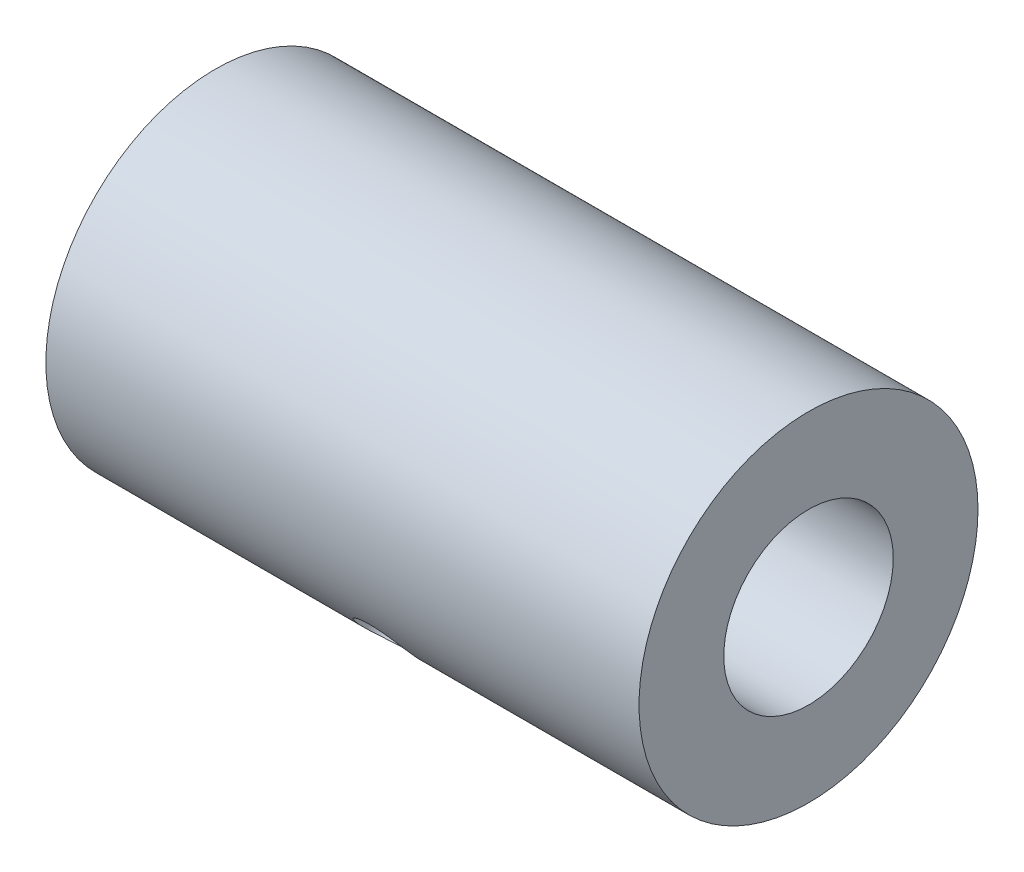
ISO-10303-21;
HEADER;
FILE_DESCRIPTION(('STEP AP214'),'2;1');
FILE_NAME('part.step','',(''),(''),'','','');
FILE_SCHEMA(('AUTOMOTIVE_DESIGN { 1 0 10303 214 1 1 1 1 }'));
ENDSEC;
DATA;
#1=APPLICATION_CONTEXT('core data for automotive mechanical design processes');
#2=APPLICATION_PROTOCOL_DEFINITION('international standard','automotive_design',2000,#1);
#3=PRODUCT_CONTEXT('',#1,'mechanical');
#4=PRODUCT('Part','Part','',(#3));
#5=PRODUCT_RELATED_PRODUCT_CATEGORY('part','',(#4));
#6=PRODUCT_DEFINITION_FORMATION('','',#4);
#7=PRODUCT_DEFINITION_CONTEXT('part definition',#1,'design');
#8=PRODUCT_DEFINITION('design','',#6,#7);
#9=PRODUCT_DEFINITION_SHAPE('','',#8);
#10=(LENGTH_UNIT() NAMED_UNIT(*) SI_UNIT(.MILLI.,.METRE.));
#11=(NAMED_UNIT(*) PLANE_ANGLE_UNIT() SI_UNIT($,.RADIAN.));
#12=(NAMED_UNIT(*) SI_UNIT($,.STERADIAN.) SOLID_ANGLE_UNIT());
#13=UNCERTAINTY_MEASURE_WITH_UNIT(LENGTH_MEASURE(1.E-05),#10,'distance_accuracy_value','');
#14=(GEOMETRIC_REPRESENTATION_CONTEXT(3) GLOBAL_UNCERTAINTY_ASSIGNED_CONTEXT((#13)) GLOBAL_UNIT_ASSIGNED_CONTEXT((#10,
#11,#12)) REPRESENTATION_CONTEXT('',''));
#15=CARTESIAN_POINT('',(0.,0.,0.));
#16=DIRECTION('',(0.,0.,1.));
#17=DIRECTION('',(1.,0.,0.));
#18=AXIS2_PLACEMENT_3D('',#15,#16,#17);
#19=CARTESIAN_POINT('',(34.9999999999995,-27.9999999999999,179.999999999996));
#20=DIRECTION('',(1.,0.,0.));
#21=DIRECTION('',(0.,0.,-1.));
#22=AXIS2_PLACEMENT_3D('',#19,#20,#21);
#23=PLANE('',#22);
#24=CARTESIAN_POINT('',(34.9999999999995,-27.9999999999999,179.999999999996));
#25=DIRECTION('',(1.,0.,0.));
#26=DIRECTION('',(0.,0.,-1.));
#27=AXIS2_PLACEMENT_3D('',#24,#25,#26);
#28=CIRCLE('',#27,20.);
#29=CARTESIAN_POINT('',(34.9999999999995,-27.9999999999999,159.999999999996));
#30=VERTEX_POINT('',#29);
#31=EDGE_CURVE('E10',#30,#30,#28,.T.);
#32=ORIENTED_EDGE('',*,*,#31,.T.);
#33=EDGE_LOOP('',(#32));
#34=FACE_BOUND('',#33,.T.);
#35=CARTESIAN_POINT('',(34.9999999999995,-27.9999999999999,179.999999999996));
#36=DIRECTION('',(1.,0.,0.));
#37=DIRECTION('',(0.,0.,-1.));
#38=AXIS2_PLACEMENT_3D('',#35,#36,#37);
#39=CIRCLE('',#38,10.);
#40=CARTESIAN_POINT('',(34.9999999999995,-27.9999999999999,169.999999999996));
#41=VERTEX_POINT('',#40);
#42=EDGE_CURVE('E46',#41,#41,#39,.T.);
#43=ORIENTED_EDGE('',*,*,#42,.F.);
#44=EDGE_LOOP('',(#43));
#45=FACE_BOUND('',#44,.T.);
#46=ADVANCED_FACE('F34',(#34,#45),#23,.T.);
#47=CARTESIAN_POINT('',(-35.0000000000005,-28.,179.999999999999));
#48=DIRECTION('',(1.,0.,0.));
#49=DIRECTION('',(0.,0.,-1.));
#50=AXIS2_PLACEMENT_3D('',#47,#48,#49);
#51=PLANE('',#50);
#52=CARTESIAN_POINT('',(-35.0000000000005,-28.,179.999999999999));
#53=DIRECTION('',(1.,0.,0.));
#54=DIRECTION('',(0.,0.,-1.));
#55=AXIS2_PLACEMENT_3D('',#52,#53,#54);
#56=CIRCLE('',#55,20.);
#57=CARTESIAN_POINT('',(-35.0000000000005,-28.,159.999999999999));
#58=VERTEX_POINT('',#57);
#59=EDGE_CURVE('E39',#58,#58,#56,.T.);
#60=ORIENTED_EDGE('',*,*,#59,.F.);
#61=EDGE_LOOP('',(#60));
#62=FACE_BOUND('',#61,.T.);
#63=CARTESIAN_POINT('',(-35.0000000000005,-28.,179.999999999999));
#64=DIRECTION('',(1.,0.,0.));
#65=DIRECTION('',(0.,0.,-1.));
#66=AXIS2_PLACEMENT_3D('',#63,#64,#65);
#67=CIRCLE('',#66,10.);
#68=CARTESIAN_POINT('',(-35.0000000000005,-28.,169.999999999999));
#69=VERTEX_POINT('',#68);
#70=EDGE_CURVE('E48',#69,#69,#67,.T.);
#71=ORIENTED_EDGE('',*,*,#70,.T.);
#72=EDGE_LOOP('',(#71));
#73=FACE_BOUND('',#72,.T.);
#74=ADVANCED_FACE('F75',(#62,#73),#51,.F.);
#75=CARTESIAN_POINT('',(34.9999999999995,-27.9999999999999,179.999999999996));
#76=DIRECTION('',(-1.,0.,0.));
#77=DIRECTION('',(0.,0.,1.));
#78=AXIS2_PLACEMENT_3D('',#75,#76,#77);
#79=CYLINDRICAL_SURFACE('',#78,20.);
#80=CARTESIAN_POINT('',(0.,-43.8478675095896,192.200208826021));
#81=CARTESIAN_POINT('',(-0.189493070074265,-43.8478642884116,192.200216500374));
#82=CARTESIAN_POINT('',(-0.379088226910519,-43.8380418027767,192.213005159529));
#83=CARTESIAN_POINT('',(-0.7529548157544,-43.7988737220687,192.26362810572));
#84=CARTESIAN_POINT('',(-0.93722123851401,-43.7695103427631,192.301485207474));
#85=CARTESIAN_POINT('',(-1.29496575548329,-43.6917161907488,192.400563797644));
#86=CARTESIAN_POINT('',(-1.46845287771228,-43.643301630247,192.461765418947));
#87=CARTESIAN_POINT('',(-1.80001657600008,-43.5281243067376,192.604989557871));
#88=CARTESIAN_POINT('',(-1.95809480216019,-43.4613635113144,192.687009842673));
#89=CARTESIAN_POINT('',(-2.25599160663239,-43.3097997578666,192.869506185747));
#90=CARTESIAN_POINT('',(-2.39562931231476,-43.2248368565512,192.970144697845));
#91=CARTESIAN_POINT('',(-2.65110950917139,-43.0386323396305,193.18558951528));
#92=CARTESIAN_POINT('',(-2.76695056764245,-42.9373897445422,193.300396672991));
#93=CARTESIAN_POINT('',(-2.97223024479482,-42.7198074031309,193.540815256522));
#94=CARTESIAN_POINT('',(-3.06150018369737,-42.6033776819167,193.666489434732));
#95=CARTESIAN_POINT('',(-3.21001898120134,-42.3584042136243,193.923639043545));
#96=CARTESIAN_POINT('',(-3.26926986995337,-42.2298612864446,194.055114081189));
#97=CARTESIAN_POINT('',(-3.35551449220155,-41.965078642617,194.318207295259));
#98=CARTESIAN_POINT('',(-3.38281229682062,-41.8289246169158,194.449811992555));
#99=CARTESIAN_POINT('',(-3.40532168994776,-41.5514842340555,194.710318513929));
#100=CARTESIAN_POINT('',(-3.40053554352118,-41.4101982399039,194.839220528166));
#101=CARTESIAN_POINT('',(-3.35924943005332,-41.1281076775969,195.089333102894));
#102=CARTESIAN_POINT('',(-3.32307672771782,-40.9873131477725,195.2106092267));
#103=CARTESIAN_POINT('',(-3.22055998370281,-40.7090528748401,195.443864724699));
#104=CARTESIAN_POINT('',(-3.15421499428137,-40.5715872364387,195.555843806732));
#105=CARTESIAN_POINT('',(-2.99291378290257,-40.3037178604791,195.76857474));
#106=CARTESIAN_POINT('',(-2.89782332628052,-40.1733507171525,195.869270810813));
#107=CARTESIAN_POINT('',(-2.68182887728862,-39.9246914722826,196.056962331432));
#108=CARTESIAN_POINT('',(-2.56092271344902,-39.8064003877464,196.143956627652));
#109=CARTESIAN_POINT('',(-2.29491554965887,-39.5845669861474,196.3038884349));
#110=CARTESIAN_POINT('',(-2.14952846863203,-39.4812296366562,196.376634695517));
#111=CARTESIAN_POINT('',(-1.83964871299826,-39.2949266598861,196.5056812871));
#112=CARTESIAN_POINT('',(-1.67515584809078,-39.2119612355445,196.561981454237));
#113=CARTESIAN_POINT('',(-1.33140168986874,-39.0695605382773,196.657497583558));
#114=CARTESIAN_POINT('',(-1.15212290614707,-39.0101536295267,196.696692957437));
#115=CARTESIAN_POINT('',(-0.784071452319234,-38.917486316467,196.757433940006));
#116=CARTESIAN_POINT('',(-0.59529965582725,-38.8842235108604,196.778981169659));
#117=CARTESIAN_POINT('',(-0.216131912408722,-38.8455207911845,196.80402364628));
#118=CARTESIAN_POINT('',(-0.0257852600498503,-38.8397404334286,196.807739784401));
#119=CARTESIAN_POINT('',(0.35332091107603,-38.8553265012548,196.797677499059));
#120=CARTESIAN_POINT('',(0.54208049342597,-38.8766918340298,196.783899779848));
#121=CARTESIAN_POINT('',(0.911376680240458,-38.94542181647,196.739157303632));
#122=CARTESIAN_POINT('',(1.0919594086093,-38.9926135976572,196.708306807463));
#123=CARTESIAN_POINT('',(1.44124173476309,-39.1109516386634,196.629845569124));
#124=CARTESIAN_POINT('',(1.60994059517754,-39.1820993833222,196.582233788048));
#125=CARTESIAN_POINT('',(1.93244432755111,-39.3463783789534,196.470265208342));
#126=CARTESIAN_POINT('',(2.08609103257776,-39.4397137021744,196.405752362127));
#127=CARTESIAN_POINT('',(2.37249181126991,-39.6445168100097,196.261024363957));
#128=CARTESIAN_POINT('',(2.50524435231321,-39.7559859235497,196.180808061093));
#129=CARTESIAN_POINT('',(2.74755455370418,-39.994405108544,196.004886392378));
#130=CARTESIAN_POINT('',(2.85684504822165,-40.1215099625537,195.909022480201));
#131=CARTESIAN_POINT('',(3.04725529573393,-40.3858125168757,195.704125811333));
#132=CARTESIAN_POINT('',(3.12837598809698,-40.5230098804518,195.595093493926));
#133=CARTESIAN_POINT('',(3.25973055945805,-40.8022669515314,195.366662824342));
#134=CARTESIAN_POINT('',(3.3101029258262,-40.9443017696553,195.247313756157));
#135=CARTESIAN_POINT('',(3.37897633227449,-41.2292562215645,195.000741753026));
#136=CARTESIAN_POINT('',(3.39748010540239,-41.3721757784195,194.873519494252));
#137=CARTESIAN_POINT('',(3.40200989952848,-41.6527620514411,194.616355732511));
#138=CARTESIAN_POINT('',(3.38844195489187,-41.7904722507082,194.486468643994));
#139=CARTESIAN_POINT('',(3.33009337565957,-42.0587106374362,194.226298768145));
#140=CARTESIAN_POINT('',(3.2853129333304,-42.1892388691322,194.096015983255));
#141=CARTESIAN_POINT('',(3.16596872163328,-42.4397108034622,193.839324369437));
#142=CARTESIAN_POINT('',(3.0914408154005,-42.5596670397266,193.712911072381));
#143=CARTESIAN_POINT('',(2.91476294747457,-42.7865553917649,193.467950374912));
#144=CARTESIAN_POINT('',(2.81261159136227,-42.8934868496585,193.349403371964));
#145=CARTESIAN_POINT('',(2.5821534080337,-43.0934694340321,193.122892653592));
#146=CARTESIAN_POINT('',(2.453549829676,-43.1863402650668,193.01507164791));
#147=CARTESIAN_POINT('',(2.17445967392031,-43.3550743464968,192.815568947062));
#148=CARTESIAN_POINT('',(2.0239679774177,-43.4309336077163,192.723891038496));
#149=CARTESIAN_POINT('',(1.70405031804502,-43.5649201240748,192.559642190882));
#150=CARTESIAN_POINT('',(1.53449258045914,-43.6229121188264,192.48721754375));
#151=CARTESIAN_POINT('',(1.18220552599729,-43.7194686841489,192.365451638667));
#152=CARTESIAN_POINT('',(0.999489465244525,-43.758052502626,192.316087514102));
#153=CARTESIAN_POINT('',(0.68007231447971,-43.8070174172052,192.253132571508));
#154=CARTESIAN_POINT('',(0.545296195637071,-43.8223228220729,192.233330772807));
#155=CARTESIAN_POINT('',(0.273697779400595,-43.8427489328907,192.206866255762));
#156=CARTESIAN_POINT('',(0.136875521734776,-43.8478698363259,192.200203282646));
#157=CARTESIAN_POINT('',(0.,-43.8478675095896,192.200208826021));
#158=B_SPLINE_CURVE_WITH_KNOTS('',3,(#80,#81,#82,#83,#84,#85,#86,#87,#88,#89,#90,#91,#92,#93,
#94,#95,#96,#97,#98,#99,#100,#101,#102,#103,#104,#105,#106,#107,#108,#109,#110,#111,#112,#113,
#114,#115,#116,#117,#118,#119,#120,#121,#122,#123,#124,#125,#126,#127,#128,#129,#130,#131,#132,
#133,#134,#135,#136,#137,#138,#139,#140,#141,#142,#143,#144,#145,#146,#147,#148,#149,#150,#151,
#152,#153,#154,#155,#156,#157),.UNSPECIFIED.,.T.,.F.,(4,2,2,2,2,2,2,2,2,2,2,2,2,2,2,2,2,2,2,2,2,
2,2,2,2,2,2,2,2,2,2,2,2,2,2,2,2,2,4),(0.,0.567978626740444,1.13647488094917,1.70448839783975,
2.27244102056136,2.84560550067497,3.41880447867685,3.99556823756002,4.57229298542716,
5.14348371475879,5.71463411954619,6.2798997973671,6.84518323197867,7.41314829255997,
7.98116114594965,8.55634227566922,9.13152913489304,9.70740642494443,10.2832308153316,
10.8519031601934,11.420552612673,11.9854415722235,12.5503655511999,13.1207015003046,
13.6910792650364,14.2676428594978,14.8441872256542,15.4181153565182,15.9919942649046,
16.5586467387672,17.1252957221261,17.6912636146941,18.2572600823982,18.8299911133592,
19.4028563083743,19.9799573480924,20.5564849183712,20.9667578553517,21.3770228367509),.UNSPECIFIED.);
#159=CARTESIAN_POINT('',(0.,-43.8478675095896,192.200208826021));
#160=VERTEX_POINT('',#159);
#161=EDGE_CURVE('E51',#160,#160,#158,.T.);
#162=ORIENTED_EDGE('',*,*,#161,.T.);
#163=EDGE_LOOP('',(#162));
#164=FACE_BOUND('',#163,.T.);
#165=ORIENTED_EDGE('',*,*,#31,.F.);
#166=EDGE_LOOP('',(#165));
#167=FACE_BOUND('',#166,.T.);
#168=ORIENTED_EDGE('',*,*,#59,.T.);
#169=EDGE_LOOP('',(#168));
#170=FACE_BOUND('',#169,.T.);
#171=ADVANCED_FACE('F36',(#164,#167,#170),#79,.T.);
#172=CARTESIAN_POINT('',(34.9999999999995,-27.9999999999999,179.999999999996));
#173=DIRECTION('',(-1.,0.,0.));
#174=DIRECTION('',(0.,0.,1.));
#175=AXIS2_PLACEMENT_3D('',#172,#173,#174);
#176=CYLINDRICAL_SURFACE('',#175,10.);
#177=CARTESIAN_POINT('',(0.,-36.8700113853474,184.617672359945));
#178=CARTESIAN_POINT('',(-0.184953420483283,-36.8700117247413,184.617670263906));
#179=CARTESIAN_POINT('',(-0.369895511118459,-36.862603967697,184.631985013656));
#180=CARTESIAN_POINT('',(-0.734285524505104,-36.8329402352937,184.688300140468));
#181=CARTESIAN_POINT('',(-0.913732720692621,-36.8106823051575,184.730304162352));
#182=CARTESIAN_POINT('',(-1.2617921691129,-36.7512674942639,184.839331118686));
#183=CARTESIAN_POINT('',(-1.430425554121,-36.7141407681928,184.906303397341));
#184=CARTESIAN_POINT('',(-1.75316390833661,-36.6247904232163,185.061718730125));
#185=CARTESIAN_POINT('',(-1.90726546208993,-36.5725632668872,185.150166814394));
#186=CARTESIAN_POINT('',(-2.20284172907644,-36.450561108674,185.348083133871));
#187=CARTESIAN_POINT('',(-2.34363869593045,-36.3802085699738,185.458207781161));
#188=CARTESIAN_POINT('',(-2.60251129740287,-36.2228857694676,185.692454008498));
#189=CARTESIAN_POINT('',(-2.7205831148318,-36.1359127207618,185.816577934488));
#190=CARTESIAN_POINT('',(-2.93375754891923,-35.9430218027868,186.077449192839));
#191=CARTESIAN_POINT('',(-3.02814598687052,-35.8366519840155,186.214448461202));
#192=CARTESIAN_POINT('',(-3.1865408088904,-35.607842582568,186.492541254117));
#193=CARTESIAN_POINT('',(-3.25055573382332,-35.4854075297235,186.633633615857));
#194=CARTESIAN_POINT('',(-3.34407614799048,-35.2315395507829,186.909317188308));
#195=CARTESIAN_POINT('',(-3.37474354767113,-35.1005907348036,187.043959273706));
#196=CARTESIAN_POINT('',(-3.40439717563325,-34.8293875533955,187.30719764516));
#197=CARTESIAN_POINT('',(-3.40339189225242,-34.6891356912553,187.435795541817));
#198=CARTESIAN_POINT('',(-3.37045649771219,-34.4095566524052,187.677917257882));
#199=CARTESIAN_POINT('',(-3.33978930884868,-34.2704250531762,187.791841958893));
#200=CARTESIAN_POINT('',(-3.2504945861652,-33.9920184997101,188.007920005073));
#201=CARTESIAN_POINT('',(-3.19186513876326,-33.852743536313,188.110072544026));
#202=CARTESIAN_POINT('',(-3.04759669596928,-33.5767351351087,188.302332003815));
#203=CARTESIAN_POINT('',(-2.96160609055234,-33.4400608136595,188.392259049049));
#204=CARTESIAN_POINT('',(-2.76534899141521,-33.175761407853,188.557794596424));
#205=CARTESIAN_POINT('',(-2.65507555955672,-33.0481389236114,188.633398994761));
#206=CARTESIAN_POINT('',(-2.40706037588065,-32.8004407572191,188.7736549209));
#207=CARTESIAN_POINT('',(-2.26823978575601,-32.6810384752269,188.837590809982));
#208=CARTESIAN_POINT('',(-1.97029791012576,-32.4619299213674,188.950217624781));
#209=CARTESIAN_POINT('',(-1.81117323414383,-32.3622269460898,188.998905999691));
#210=CARTESIAN_POINT('',(-1.47392005703145,-32.1858459851494,189.082312227349));
#211=CARTESIAN_POINT('',(-1.29553720080128,-32.1095451835609,189.116804007418));
#212=CARTESIAN_POINT('',(-0.926795423319229,-31.9864355820184,189.171309492722));
#213=CARTESIAN_POINT('',(-0.736441805911085,-31.939613820743,189.191329561441));
#214=CARTESIAN_POINT('',(-0.358687922972542,-31.879892297497,189.216693846688));
#215=CARTESIAN_POINT('',(-0.171565151773375,-31.8655099421957,189.222680001905));
#216=CARTESIAN_POINT('',(0.202499236177479,-31.8671844688404,189.221978768114));
#217=CARTESIAN_POINT('',(0.389440880723958,-31.8832355316656,189.215293801928));
#218=CARTESIAN_POINT('',(0.75076710437048,-31.9436113816212,189.189609672059));
#219=CARTESIAN_POINT('',(0.92536123351113,-31.9868904330851,189.171065561221));
#220=CARTESIAN_POINT('',(1.26457943002407,-32.0983599221374,189.121794431792));
#221=CARTESIAN_POINT('',(1.42920167910256,-32.1665548871012,189.091065199003));
#222=CARTESIAN_POINT('',(1.74976750453823,-32.3271576461183,189.015752675245));
#223=CARTESIAN_POINT('',(1.9052517259246,-32.4202838054133,188.970749499298));
#224=CARTESIAN_POINT('',(2.19795097623399,-32.6254966490264,188.866679013728));
#225=CARTESIAN_POINT('',(2.33516038994063,-32.7375891371317,188.807607396834));
#226=CARTESIAN_POINT('',(2.59456383577245,-32.9824288935249,188.671560006551));
#227=CARTESIAN_POINT('',(2.71565315524095,-33.1159322363651,188.593832162162));
#228=CARTESIAN_POINT('',(2.9308767146924,-33.3938468771157,188.422176270781));
#229=CARTESIAN_POINT('',(3.02501179224399,-33.5382578359095,188.328248727319));
#230=CARTESIAN_POINT('',(3.18281762815199,-33.8316122717417,188.125506328823));
#231=CARTESIAN_POINT('',(3.24667641013172,-33.9805214981162,188.016788901071));
#232=CARTESIAN_POINT('',(3.34240109335694,-34.2781660705035,187.785887427595));
#233=CARTESIAN_POINT('',(3.37427906347901,-34.4269014609369,187.663708481294));
#234=CARTESIAN_POINT('',(3.40401677937435,-34.7117373678982,187.415292024008));
#235=CARTESIAN_POINT('',(3.40345955105096,-34.8481003315482,187.289542939339));
#236=CARTESIAN_POINT('',(3.37227320513025,-35.1118243535296,187.032485645629));
#237=CARTESIAN_POINT('',(3.34164669532409,-35.2391861914666,186.901177919613));
#238=CARTESIAN_POINT('',(3.25225312728194,-35.4797276910992,186.639633804527));
#239=CARTESIAN_POINT('',(3.19397575139714,-35.5931124656703,186.509417435496));
#240=CARTESIAN_POINT('',(3.05139265740536,-35.8062977622402,186.252171989322));
#241=CARTESIAN_POINT('',(2.96708217172731,-35.906095791204,186.125143500604));
#242=CARTESIAN_POINT('',(2.77115750937564,-36.0945961108408,185.873935383878));
#243=CARTESIAN_POINT('',(2.65863042840525,-36.1827352367628,185.75004571493));
#244=CARTESIAN_POINT('',(2.41100145759227,-36.3429362538248,185.515041138254));
#245=CARTESIAN_POINT('',(2.27589221921544,-36.4149928936265,185.403930408896));
#246=CARTESIAN_POINT('',(1.98028554193503,-36.5457263017673,185.194844578357));
#247=CARTESIAN_POINT('',(1.81897160206508,-36.6037297149762,185.097599029533));
#248=CARTESIAN_POINT('',(1.47938230695614,-36.7026116186671,184.926898446152));
#249=CARTESIAN_POINT('',(1.30111053313017,-36.7434937152787,184.853438402579));
#250=CARTESIAN_POINT('',(0.938348484387036,-36.8073571785744,184.736537373045));
#251=CARTESIAN_POINT('',(0.754235973508985,-36.8308662203608,184.692216442004));
#252=CARTESIAN_POINT('',(0.380076784731237,-36.8621901386935,184.632790616883));
#253=CARTESIAN_POINT('',(0.190032412041551,-36.8700110366334,184.617674513543));
#254=CARTESIAN_POINT('',(0.,-36.8700113853474,184.617672359945));
#255=B_SPLINE_CURVE_WITH_KNOTS('',3,(#177,#178,#179,#180,#181,#182,#183,#184,#185,#186,#187,
#188,#189,#190,#191,#192,#193,#194,#195,#196,#197,#198,#199,#200,#201,#202,#203,#204,#205,#206,
#207,#208,#209,#210,#211,#212,#213,#214,#215,#216,#217,#218,#219,#220,#221,#222,#223,#224,#225,
#226,#227,#228,#229,#230,#231,#232,#233,#234,#235,#236,#237,#238,#239,#240,#241,#242,#243,#244,
#245,#246,#247,#248,#249,#250,#251,#252,#253,#254),.UNSPECIFIED.,.T.,.F.,(4,2,2,2,2,2,2,2,2,2,2,
2,2,2,2,2,2,2,2,2,2,2,2,2,2,2,2,2,2,2,2,2,2,2,2,2,2,2,4),(0.,0.554155936307623,1.10838483238154,
1.66149536988439,2.21473558407211,2.78843620567089,3.36223310898767,3.95167753488234,
4.54095611388148,5.10897071265863,5.67683308376681,6.22153553621601,6.7662752704318,
7.31831900526983,7.87052067629439,8.4497026534605,9.02898147216633,9.61715795470321,
10.2050756473344,10.7655266587631,11.3258705181365,11.8659072222688,12.4060421032455,
12.9638264324967,13.5217817561263,14.1078464903076,14.6938930112988,15.2762507491984,
15.8583886349404,16.4121398132918,16.9658429712116,17.5100868450781,18.0544304481677,
18.619383823442,19.1845214012718,19.7729365795807,20.3612277621795,20.9308199934138,
21.500193562978),.UNSPECIFIED.);
#256=CARTESIAN_POINT('',(0.,-36.8700113853474,184.617672359945));
#257=VERTEX_POINT('',#256);
#258=EDGE_CURVE('E59',#257,#257,#255,.T.);
#259=ORIENTED_EDGE('',*,*,#258,.F.);
#260=EDGE_LOOP('',(#259));
#261=FACE_BOUND('',#260,.T.);
#262=ORIENTED_EDGE('',*,*,#42,.T.);
#263=EDGE_LOOP('',(#262));
#264=FACE_BOUND('',#263,.T.);
#265=ORIENTED_EDGE('',*,*,#70,.F.);
#266=EDGE_LOOP('',(#265));
#267=FACE_BOUND('',#266,.T.);
#268=ADVANCED_FACE('F66',(#261,#264,#267),#176,.F.);
#269=CARTESIAN_POINT('',(0.,-41.5431514376434,194.716760823533));
#270=DIRECTION('',(0.,-0.67715757188217,0.735838041176619));
#271=DIRECTION('',(0.,-0.735838041176619,-0.67715757188217));
#272=AXIS2_PLACEMENT_3D('',#269,#270,#271);
#273=CYLINDRICAL_SURFACE('',#272,3.39999999999999);
#274=ORIENTED_EDGE('',*,*,#258,.T.);
#275=EDGE_LOOP('',(#274));
#276=FACE_BOUND('',#275,.T.);
#277=ORIENTED_EDGE('',*,*,#161,.F.);
#278=EDGE_LOOP('',(#277));
#279=FACE_BOUND('',#278,.T.);
#280=ADVANCED_FACE('F63',(#276,#279),#273,.F.);
#281=CLOSED_SHELL('',(#46,#74,#171,#268,#280));
#282=MANIFOLD_SOLID_BREP('B2',#281);
#283=ADVANCED_BREP_SHAPE_REPRESENTATION('',(#18,#282),#14);
#284=SHAPE_DEFINITION_REPRESENTATION(#9,#283);
ENDSEC;
END-ISO-10303-21;
